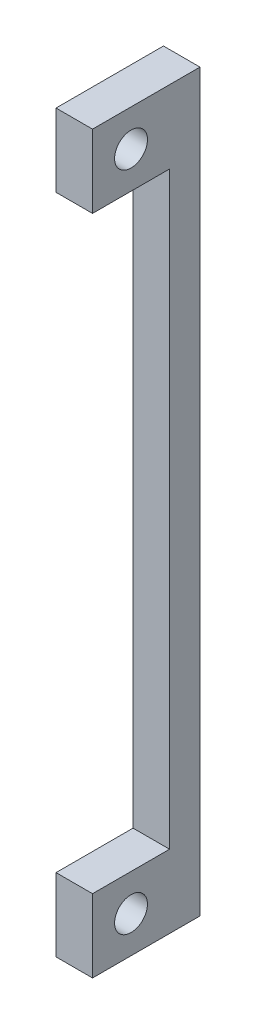
ISO-10303-21;
HEADER;
FILE_DESCRIPTION(('STEP AP214'),'2;1');
FILE_NAME('part.step','',(''),(''),'','','');
FILE_SCHEMA(('AUTOMOTIVE_DESIGN { 1 0 10303 214 1 1 1 1 }'));
ENDSEC;
DATA;
#1=APPLICATION_CONTEXT('core data for automotive mechanical design processes');
#2=APPLICATION_PROTOCOL_DEFINITION('international standard','automotive_design',2000,#1);
#3=PRODUCT_CONTEXT('',#1,'mechanical');
#4=PRODUCT('Part','Part','',(#3));
#5=PRODUCT_RELATED_PRODUCT_CATEGORY('part','',(#4));
#6=PRODUCT_DEFINITION_FORMATION('','',#4);
#7=PRODUCT_DEFINITION_CONTEXT('part definition',#1,'design');
#8=PRODUCT_DEFINITION('design','',#6,#7);
#9=PRODUCT_DEFINITION_SHAPE('','',#8);
#10=(LENGTH_UNIT() NAMED_UNIT(*) SI_UNIT(.MILLI.,.METRE.));
#11=(NAMED_UNIT(*) PLANE_ANGLE_UNIT() SI_UNIT($,.RADIAN.));
#12=(NAMED_UNIT(*) SI_UNIT($,.STERADIAN.) SOLID_ANGLE_UNIT());
#13=UNCERTAINTY_MEASURE_WITH_UNIT(LENGTH_MEASURE(1.E-05),#10,'distance_accuracy_value','');
#14=(GEOMETRIC_REPRESENTATION_CONTEXT(3) GLOBAL_UNCERTAINTY_ASSIGNED_CONTEXT((#13)) GLOBAL_UNIT_ASSIGNED_CONTEXT((#10,
#11,#12)) REPRESENTATION_CONTEXT('',''));
#15=CARTESIAN_POINT('',(0.,0.,0.));
#16=DIRECTION('',(0.,0.,1.));
#17=DIRECTION('',(1.,0.,0.));
#18=AXIS2_PLACEMENT_3D('',#15,#16,#17);
#19=CARTESIAN_POINT('',(0.,0.,2.5));
#20=DIRECTION('',(0.,0.,1.));
#21=DIRECTION('',(1.,0.,0.));
#22=AXIS2_PLACEMENT_3D('',#19,#20,#21);
#23=PLANE('',#22);
#24=DIRECTION('',(-1.,0.,0.));
#25=VECTOR('',#24,1.);
#26=CARTESIAN_POINT('',(0.,-54.4,2.5));
#27=LINE('',#26,#25);
#28=CARTESIAN_POINT('',(0.,-54.4,2.5));
#29=VERTEX_POINT('',#28);
#30=CARTESIAN_POINT('',(-2.99999999999999,-54.4,2.5));
#31=VERTEX_POINT('',#30);
#32=EDGE_CURVE('E111',#29,#31,#27,.T.);
#33=ORIENTED_EDGE('',*,*,#32,.F.);
#34=DIRECTION('',(0.,-1.,0.));
#35=VECTOR('',#34,1.);
#36=CARTESIAN_POINT('',(0.,0.,2.5));
#37=LINE('',#36,#35);
#38=CARTESIAN_POINT('',(0.,-6.,2.5));
#39=VERTEX_POINT('',#38);
#40=EDGE_CURVE('E156',#39,#29,#37,.T.);
#41=ORIENTED_EDGE('',*,*,#40,.F.);
#42=DIRECTION('',(-1.,0.,0.));
#43=VECTOR('',#42,1.);
#44=CARTESIAN_POINT('',(0.,-6.,2.5));
#45=LINE('',#44,#43);
#46=CARTESIAN_POINT('',(-3.,-6.,2.5));
#47=VERTEX_POINT('',#46);
#48=EDGE_CURVE('E150',#39,#47,#45,.T.);
#49=ORIENTED_EDGE('',*,*,#48,.T.);
#50=DIRECTION('',(0.,-1.,0.));
#51=VECTOR('',#50,1.);
#52=CARTESIAN_POINT('',(-3.,0.,2.5));
#53=LINE('',#52,#51);
#54=EDGE_CURVE('E154',#47,#31,#53,.T.);
#55=ORIENTED_EDGE('',*,*,#54,.T.);
#56=EDGE_LOOP('',(#33,#41,#49,#55));
#57=FACE_BOUND('',#56,.T.);
#58=ADVANCED_FACE('F35',(#57),#23,.T.);
#59=CARTESIAN_POINT('',(-3.,0.,2.5));
#60=DIRECTION('',(1.,0.,0.));
#61=DIRECTION('',(0.,1.,0.));
#62=AXIS2_PLACEMENT_3D('',#59,#60,#61);
#63=PLANE('',#62);
#64=CARTESIAN_POINT('',(-3.,-3.,5.66375));
#65=DIRECTION('',(-1.,0.,0.));
#66=DIRECTION('',(0.,-1.,0.));
#67=AXIS2_PLACEMENT_3D('',#64,#65,#66);
#68=CIRCLE('',#67,1.35);
#69=CARTESIAN_POINT('',(-3.,-4.35,5.66375));
#70=VERTEX_POINT('',#69);
#71=EDGE_CURVE('E171',#70,#70,#68,.T.);
#72=ORIENTED_EDGE('',*,*,#71,.F.);
#73=EDGE_LOOP('',(#72));
#74=FACE_BOUND('',#73,.T.);
#75=CARTESIAN_POINT('',(-2.99999999999999,-57.4,5.66375));
#76=DIRECTION('',(-1.,0.,0.));
#77=DIRECTION('',(0.,-1.,0.));
#78=AXIS2_PLACEMENT_3D('',#75,#76,#77);
#79=CIRCLE('',#78,1.35);
#80=CARTESIAN_POINT('',(-2.99999999999999,-58.75,5.66375));
#81=VERTEX_POINT('',#80);
#82=EDGE_CURVE('E131',#81,#81,#79,.T.);
#83=ORIENTED_EDGE('',*,*,#82,.F.);
#84=EDGE_LOOP('',(#83));
#85=FACE_BOUND('',#84,.T.);
#86=DIRECTION('',(0.,-1.,0.));
#87=VECTOR('',#86,1.);
#88=CARTESIAN_POINT('',(-3.,0.,0.));
#89=LINE('',#88,#87);
#90=CARTESIAN_POINT('',(-3.,0.,0.));
#91=VERTEX_POINT('',#90);
#92=CARTESIAN_POINT('',(-2.99999999999999,-60.4,0.));
#93=VERTEX_POINT('',#92);
#94=EDGE_CURVE('E153',#91,#93,#89,.T.);
#95=ORIENTED_EDGE('',*,*,#94,.T.);
#96=DIRECTION('',(0.,0.,-1.));
#97=VECTOR('',#96,1.);
#98=CARTESIAN_POINT('',(-2.99999999999999,-60.4,2.5));
#99=LINE('',#98,#97);
#100=CARTESIAN_POINT('',(-2.99999999999999,-60.4,8.8275));
#101=VERTEX_POINT('',#100);
#102=EDGE_CURVE('E11',#101,#93,#99,.T.);
#103=ORIENTED_EDGE('',*,*,#102,.F.);
#104=DIRECTION('',(0.,-1.,0.));
#105=VECTOR('',#104,1.);
#106=CARTESIAN_POINT('',(-3.,0.,8.8275));
#107=LINE('',#106,#105);
#108=CARTESIAN_POINT('',(-2.99999999999999,-54.4,8.8275));
#109=VERTEX_POINT('',#108);
#110=EDGE_CURVE('E118',#109,#101,#107,.T.);
#111=ORIENTED_EDGE('',*,*,#110,.F.);
#112=DIRECTION('',(0.,0.,-1.));
#113=VECTOR('',#112,1.);
#114=CARTESIAN_POINT('',(-2.99999999999999,-54.4,8.8275));
#115=LINE('',#114,#113);
#116=EDGE_CURVE('E104',#109,#31,#115,.T.);
#117=ORIENTED_EDGE('',*,*,#116,.T.);
#118=ORIENTED_EDGE('',*,*,#54,.F.);
#119=DIRECTION('',(0.,0.,-1.));
#120=VECTOR('',#119,1.);
#121=CARTESIAN_POINT('',(-3.,-6.,8.8275));
#122=LINE('',#121,#120);
#123=CARTESIAN_POINT('',(-3.,-6.,8.8275));
#124=VERTEX_POINT('',#123);
#125=EDGE_CURVE('E148',#124,#47,#122,.T.);
#126=ORIENTED_EDGE('',*,*,#125,.F.);
#127=DIRECTION('',(0.,-1.,0.));
#128=VECTOR('',#127,1.);
#129=CARTESIAN_POINT('',(-3.,0.,8.8275));
#130=LINE('',#129,#128);
#131=CARTESIAN_POINT('',(-3.,0.,8.8275));
#132=VERTEX_POINT('',#131);
#133=EDGE_CURVE('E141',#132,#124,#130,.T.);
#134=ORIENTED_EDGE('',*,*,#133,.F.);
#135=DIRECTION('',(0.,0.,-1.));
#136=VECTOR('',#135,1.);
#137=CARTESIAN_POINT('',(-3.,0.,2.5));
#138=LINE('',#137,#136);
#139=EDGE_CURVE('E158',#132,#91,#138,.T.);
#140=ORIENTED_EDGE('',*,*,#139,.T.);
#141=EDGE_LOOP('',(#95,#103,#111,#117,#118,#126,#134,#140));
#142=FACE_BOUND('',#141,.T.);
#143=ADVANCED_FACE('F37',(#74,#85,#142),#63,.F.);
#144=CARTESIAN_POINT('',(0.,-60.4,2.5));
#145=DIRECTION('',(0.,-1.,0.));
#146=DIRECTION('',(0.,0.,-1.));
#147=AXIS2_PLACEMENT_3D('',#144,#145,#146);
#148=PLANE('',#147);
#149=DIRECTION('',(-1.,0.,0.));
#150=VECTOR('',#149,1.);
#151=CARTESIAN_POINT('',(0.,-60.4,0.));
#152=LINE('',#151,#150);
#153=CARTESIAN_POINT('',(0.,-60.4,0.));
#154=VERTEX_POINT('',#153);
#155=EDGE_CURVE('E160',#154,#93,#152,.T.);
#156=ORIENTED_EDGE('',*,*,#155,.F.);
#157=DIRECTION('',(0.,0.,-1.));
#158=VECTOR('',#157,1.);
#159=CARTESIAN_POINT('',(0.,-60.4,2.5));
#160=LINE('',#159,#158);
#161=CARTESIAN_POINT('',(0.,-60.4,8.8275));
#162=VERTEX_POINT('',#161);
#163=EDGE_CURVE('E44',#162,#154,#160,.T.);
#164=ORIENTED_EDGE('',*,*,#163,.F.);
#165=DIRECTION('',(-1.,0.,0.));
#166=VECTOR('',#165,1.);
#167=CARTESIAN_POINT('',(0.,-60.4,8.8275));
#168=LINE('',#167,#166);
#169=EDGE_CURVE('E122',#162,#101,#168,.T.);
#170=ORIENTED_EDGE('',*,*,#169,.T.);
#171=ORIENTED_EDGE('',*,*,#102,.T.);
#172=EDGE_LOOP('',(#156,#164,#170,#171));
#173=FACE_BOUND('',#172,.T.);
#174=ADVANCED_FACE('F183',(#173),#148,.T.);
#175=CARTESIAN_POINT('',(0.,0.,2.5));
#176=DIRECTION('',(1.,0.,0.));
#177=DIRECTION('',(0.,1.,0.));
#178=AXIS2_PLACEMENT_3D('',#175,#176,#177);
#179=PLANE('',#178);
#180=CARTESIAN_POINT('',(0.,-3.,5.66375));
#181=DIRECTION('',(1.,0.,0.));
#182=DIRECTION('',(0.,1.,0.));
#183=AXIS2_PLACEMENT_3D('',#180,#181,#182);
#184=CIRCLE('',#183,1.35);
#185=CARTESIAN_POINT('',(0.,-1.65,5.66375));
#186=VERTEX_POINT('',#185);
#187=EDGE_CURVE('E39',#186,#186,#184,.T.);
#188=ORIENTED_EDGE('',*,*,#187,.F.);
#189=EDGE_LOOP('',(#188));
#190=FACE_BOUND('',#189,.T.);
#191=CARTESIAN_POINT('',(0.,-57.4,5.66375));
#192=DIRECTION('',(1.,0.,0.));
#193=DIRECTION('',(0.,1.,0.));
#194=AXIS2_PLACEMENT_3D('',#191,#192,#193);
#195=CIRCLE('',#194,1.35);
#196=CARTESIAN_POINT('',(0.,-56.05,5.66375));
#197=VERTEX_POINT('',#196);
#198=EDGE_CURVE('E129',#197,#197,#195,.T.);
#199=ORIENTED_EDGE('',*,*,#198,.F.);
#200=EDGE_LOOP('',(#199));
#201=FACE_BOUND('',#200,.T.);
#202=ORIENTED_EDGE('',*,*,#40,.T.);
#203=DIRECTION('',(0.,0.,-1.));
#204=VECTOR('',#203,1.);
#205=CARTESIAN_POINT('',(0.,-54.4,8.8275));
#206=LINE('',#205,#204);
#207=CARTESIAN_POINT('',(0.,-54.4,8.8275));
#208=VERTEX_POINT('',#207);
#209=EDGE_CURVE('E115',#208,#29,#206,.T.);
#210=ORIENTED_EDGE('',*,*,#209,.F.);
#211=DIRECTION('',(0.,-1.,0.));
#212=VECTOR('',#211,1.);
#213=CARTESIAN_POINT('',(0.,0.,8.8275));
#214=LINE('',#213,#212);
#215=EDGE_CURVE('E126',#208,#162,#214,.T.);
#216=ORIENTED_EDGE('',*,*,#215,.T.);
#217=ORIENTED_EDGE('',*,*,#163,.T.);
#218=DIRECTION('',(0.,-1.,0.));
#219=VECTOR('',#218,1.);
#220=CARTESIAN_POINT('',(0.,0.,0.));
#221=LINE('',#220,#219);
#222=CARTESIAN_POINT('',(0.,0.,0.));
#223=VERTEX_POINT('',#222);
#224=EDGE_CURVE('E163',#223,#154,#221,.T.);
#225=ORIENTED_EDGE('',*,*,#224,.F.);
#226=DIRECTION('',(0.,0.,-1.));
#227=VECTOR('',#226,1.);
#228=CARTESIAN_POINT('',(0.,0.,2.5));
#229=LINE('',#228,#227);
#230=CARTESIAN_POINT('',(0.,0.,8.8275));
#231=VERTEX_POINT('',#230);
#232=EDGE_CURVE('E167',#231,#223,#229,.T.);
#233=ORIENTED_EDGE('',*,*,#232,.F.);
#234=DIRECTION('',(0.,-1.,0.));
#235=VECTOR('',#234,1.);
#236=CARTESIAN_POINT('',(0.,0.,8.8275));
#237=LINE('',#236,#235);
#238=CARTESIAN_POINT('',(0.,-6.,8.8275));
#239=VERTEX_POINT('',#238);
#240=EDGE_CURVE('E145',#231,#239,#237,.T.);
#241=ORIENTED_EDGE('',*,*,#240,.T.);
#242=DIRECTION('',(0.,0.,-1.));
#243=VECTOR('',#242,1.);
#244=CARTESIAN_POINT('',(0.,-6.,8.8275));
#245=LINE('',#244,#243);
#246=EDGE_CURVE('E52',#239,#39,#245,.T.);
#247=ORIENTED_EDGE('',*,*,#246,.T.);
#248=EDGE_LOOP('',(#202,#210,#216,#217,#225,#233,#241,#247));
#249=FACE_BOUND('',#248,.T.);
#250=ADVANCED_FACE('F189',(#190,#201,#249),#179,.T.);
#251=CARTESIAN_POINT('',(0.,0.,2.5));
#252=DIRECTION('',(0.,-1.,0.));
#253=DIRECTION('',(1.,0.,0.));
#254=AXIS2_PLACEMENT_3D('',#251,#252,#253);
#255=PLANE('',#254);
#256=DIRECTION('',(-1.,0.,0.));
#257=VECTOR('',#256,1.);
#258=CARTESIAN_POINT('',(0.,0.,0.));
#259=LINE('',#258,#257);
#260=EDGE_CURVE('E60',#223,#91,#259,.T.);
#261=ORIENTED_EDGE('',*,*,#260,.T.);
#262=ORIENTED_EDGE('',*,*,#139,.F.);
#263=DIRECTION('',(-1.,0.,0.));
#264=VECTOR('',#263,1.);
#265=CARTESIAN_POINT('',(0.,0.,8.8275));
#266=LINE('',#265,#264);
#267=EDGE_CURVE('E138',#231,#132,#266,.T.);
#268=ORIENTED_EDGE('',*,*,#267,.F.);
#269=ORIENTED_EDGE('',*,*,#232,.T.);
#270=EDGE_LOOP('',(#261,#262,#268,#269));
#271=FACE_BOUND('',#270,.T.);
#272=ADVANCED_FACE('F202',(#271),#255,.F.);
#273=CARTESIAN_POINT('',(0.,0.,0.));
#274=DIRECTION('',(0.,0.,1.));
#275=DIRECTION('',(1.,0.,0.));
#276=AXIS2_PLACEMENT_3D('',#273,#274,#275);
#277=PLANE('',#276);
#278=ORIENTED_EDGE('',*,*,#224,.T.);
#279=ORIENTED_EDGE('',*,*,#155,.T.);
#280=ORIENTED_EDGE('',*,*,#94,.F.);
#281=ORIENTED_EDGE('',*,*,#260,.F.);
#282=EDGE_LOOP('',(#278,#279,#280,#281));
#283=FACE_BOUND('',#282,.T.);
#284=ADVANCED_FACE('F199',(#283),#277,.F.);
#285=CARTESIAN_POINT('',(0.,-6.,8.8275));
#286=DIRECTION('',(0.,1.,0.));
#287=DIRECTION('',(0.,0.,1.));
#288=AXIS2_PLACEMENT_3D('',#285,#286,#287);
#289=PLANE('',#288);
#290=ORIENTED_EDGE('',*,*,#48,.F.);
#291=ORIENTED_EDGE('',*,*,#246,.F.);
#292=DIRECTION('',(1.,0.,0.));
#293=VECTOR('',#292,1.);
#294=CARTESIAN_POINT('',(0.,-6.,8.8275));
#295=LINE('',#294,#293);
#296=EDGE_CURVE('E143',#124,#239,#295,.T.);
#297=ORIENTED_EDGE('',*,*,#296,.F.);
#298=ORIENTED_EDGE('',*,*,#125,.T.);
#299=EDGE_LOOP('',(#290,#291,#297,#298));
#300=FACE_BOUND('',#299,.T.);
#301=ADVANCED_FACE('F197',(#300),#289,.F.);
#302=CARTESIAN_POINT('',(0.,0.,8.8275));
#303=DIRECTION('',(0.,0.,1.));
#304=DIRECTION('',(1.,0.,0.));
#305=AXIS2_PLACEMENT_3D('',#302,#303,#304);
#306=PLANE('',#305);
#307=ORIENTED_EDGE('',*,*,#267,.T.);
#308=ORIENTED_EDGE('',*,*,#133,.T.);
#309=ORIENTED_EDGE('',*,*,#296,.T.);
#310=ORIENTED_EDGE('',*,*,#240,.F.);
#311=EDGE_LOOP('',(#307,#308,#309,#310));
#312=FACE_BOUND('',#311,.T.);
#313=ADVANCED_FACE('F219',(#312),#306,.T.);
#314=CARTESIAN_POINT('',(0.,-54.4,8.8275));
#315=DIRECTION('',(0.,1.,0.));
#316=DIRECTION('',(0.,0.,1.));
#317=AXIS2_PLACEMENT_3D('',#314,#315,#316);
#318=PLANE('',#317);
#319=ORIENTED_EDGE('',*,*,#209,.T.);
#320=ORIENTED_EDGE('',*,*,#32,.T.);
#321=ORIENTED_EDGE('',*,*,#116,.F.);
#322=DIRECTION('',(1.,0.,0.));
#323=VECTOR('',#322,1.);
#324=CARTESIAN_POINT('',(0.,-54.4,8.8275));
#325=LINE('',#324,#323);
#326=EDGE_CURVE('E108',#109,#208,#325,.T.);
#327=ORIENTED_EDGE('',*,*,#326,.T.);
#328=EDGE_LOOP('',(#319,#320,#321,#327));
#329=FACE_BOUND('',#328,.T.);
#330=ADVANCED_FACE('F106',(#329),#318,.T.);
#331=CARTESIAN_POINT('',(0.,0.,8.8275));
#332=DIRECTION('',(0.,0.,1.));
#333=DIRECTION('',(1.,0.,0.));
#334=AXIS2_PLACEMENT_3D('',#331,#332,#333);
#335=PLANE('',#334);
#336=ORIENTED_EDGE('',*,*,#326,.F.);
#337=ORIENTED_EDGE('',*,*,#110,.T.);
#338=ORIENTED_EDGE('',*,*,#169,.F.);
#339=ORIENTED_EDGE('',*,*,#215,.F.);
#340=EDGE_LOOP('',(#336,#337,#338,#339));
#341=FACE_BOUND('',#340,.T.);
#342=ADVANCED_FACE('F124',(#341),#335,.T.);
#343=CARTESIAN_POINT('',(5.82750000000001,-57.4,5.66375));
#344=DIRECTION('',(-1.,0.,0.));
#345=DIRECTION('',(0.,-1.,0.));
#346=AXIS2_PLACEMENT_3D('',#343,#344,#345);
#347=CYLINDRICAL_SURFACE('',#346,1.35);
#348=ORIENTED_EDGE('',*,*,#198,.T.);
#349=EDGE_LOOP('',(#348));
#350=FACE_BOUND('',#349,.T.);
#351=ORIENTED_EDGE('',*,*,#82,.T.);
#352=EDGE_LOOP('',(#351));
#353=FACE_BOUND('',#352,.T.);
#354=ADVANCED_FACE('F180',(#350,#353),#347,.F.);
#355=CARTESIAN_POINT('',(5.8275,-3.,5.66375));
#356=DIRECTION('',(-1.,0.,0.));
#357=DIRECTION('',(0.,-1.,0.));
#358=AXIS2_PLACEMENT_3D('',#355,#356,#357);
#359=CYLINDRICAL_SURFACE('',#358,1.35);
#360=ORIENTED_EDGE('',*,*,#187,.T.);
#361=EDGE_LOOP('',(#360));
#362=FACE_BOUND('',#361,.T.);
#363=ORIENTED_EDGE('',*,*,#71,.T.);
#364=EDGE_LOOP('',(#363));
#365=FACE_BOUND('',#364,.T.);
#366=ADVANCED_FACE('F235',(#362,#365),#359,.F.);
#367=CLOSED_SHELL('',(#58,#143,#174,#250,#272,#284,#301,#313,#330,#342,#354,#366));
#368=MANIFOLD_SOLID_BREP('B2',#367);
#369=ADVANCED_BREP_SHAPE_REPRESENTATION('',(#18,#368),#14);
#370=SHAPE_DEFINITION_REPRESENTATION(#9,#369);
ENDSEC;
END-ISO-10303-21;
